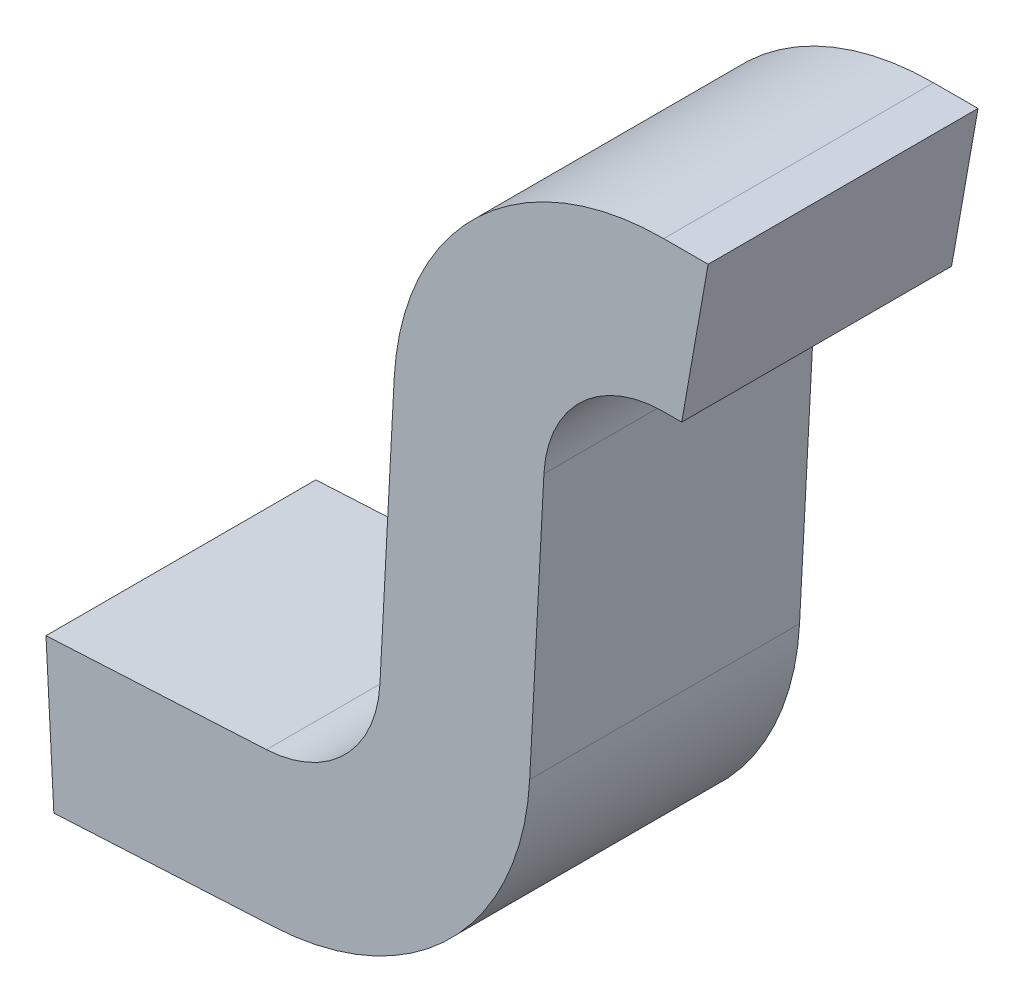
ISO-10303-21;
HEADER;
FILE_DESCRIPTION(('STEP AP214'),'2;1');
FILE_NAME('part.step','',(''),(''),'','','');
FILE_SCHEMA(('AUTOMOTIVE_DESIGN { 1 0 10303 214 1 1 1 1 }'));
ENDSEC;
DATA;
#1=APPLICATION_CONTEXT('core data for automotive mechanical design processes');
#2=APPLICATION_PROTOCOL_DEFINITION('international standard','automotive_design',2000,#1);
#3=PRODUCT_CONTEXT('',#1,'mechanical');
#4=PRODUCT('Part','Part','',(#3));
#5=PRODUCT_RELATED_PRODUCT_CATEGORY('part','',(#4));
#6=PRODUCT_DEFINITION_FORMATION('','',#4);
#7=PRODUCT_DEFINITION_CONTEXT('part definition',#1,'design');
#8=PRODUCT_DEFINITION('design','',#6,#7);
#9=PRODUCT_DEFINITION_SHAPE('','',#8);
#10=(LENGTH_UNIT() NAMED_UNIT(*) SI_UNIT(.MILLI.,.METRE.));
#11=(NAMED_UNIT(*) PLANE_ANGLE_UNIT() SI_UNIT($,.RADIAN.));
#12=(NAMED_UNIT(*) SI_UNIT($,.STERADIAN.) SOLID_ANGLE_UNIT());
#13=UNCERTAINTY_MEASURE_WITH_UNIT(LENGTH_MEASURE(1.E-05),#10,'distance_accuracy_value','');
#14=(GEOMETRIC_REPRESENTATION_CONTEXT(3) GLOBAL_UNCERTAINTY_ASSIGNED_CONTEXT((#13)) GLOBAL_UNIT_ASSIGNED_CONTEXT((#10,
#11,#12)) REPRESENTATION_CONTEXT('',''));
#15=CARTESIAN_POINT('',(0.,0.,0.));
#16=DIRECTION('',(0.,0.,1.));
#17=DIRECTION('',(1.,0.,0.));
#18=AXIS2_PLACEMENT_3D('',#15,#16,#17);
#19=CARTESIAN_POINT('',(0.,0.,-0.5375));
#20=DIRECTION('',(0.,0.,-1.));
#21=DIRECTION('',(-1.,0.,0.));
#22=AXIS2_PLACEMENT_3D('',#19,#20,#21);
#23=PLANE('',#22);
#24=DIRECTION('',(0.0523359562429177,0.998629534754575,0.));
#25=VECTOR('',#24,1.);
#26=CARTESIAN_POINT('',(-0.861573213012,-0.31493822705,-0.5375));
#27=LINE('',#26,#25);
#28=CARTESIAN_POINT('',(-0.849691645319655,-0.0882244098453541,-0.5375));
#29=VERTEX_POINT('',#28);
#30=CARTESIAN_POINT('',(-0.861573213012008,-0.31493822705016,-0.5375));
#31=VERTEX_POINT('',#30);
#32=EDGE_CURVE('E145',#29,#31,#27,.F.);
#33=ORIENTED_EDGE('',*,*,#32,.T.);
#34=CARTESIAN_POINT('',(-0.961436166488,-0.309704631426,-0.5375));
#35=DIRECTION('',(0.,0.,-1.));
#36=DIRECTION('',(-1.,0.,0.));
#37=AXIS2_PLACEMENT_3D('',#34,#35,#36);
#38=CIRCLE('',#37,0.1);
#39=CARTESIAN_POINT('',(-0.956202570863354,-0.40956758490123,-0.5375));
#40=VERTEX_POINT('',#39);
#41=EDGE_CURVE('E181',#31,#40,#38,.T.);
#42=ORIENTED_EDGE('',*,*,#41,.T.);
#43=DIRECTION('',(0.998629534754575,0.0523359562429177,0.));
#44=VECTOR('',#43,1.);
#45=CARTESIAN_POINT('',(-1.14,-0.4192,-0.5375));
#46=LINE('',#45,#44);
#47=CARTESIAN_POINT('',(-1.14000000000012,-0.419200000000006,-0.5375));
#48=VERTEX_POINT('',#47);
#49=EDGE_CURVE('E149',#40,#48,#46,.F.);
#50=ORIENTED_EDGE('',*,*,#49,.T.);
#51=DIRECTION('',(-0.0523359562429177,0.998629534754575,0.));
#52=VECTOR('',#51,1.);
#53=CARTESIAN_POINT('',(-1.13345800547,-0.544028691844,-0.5375));
#54=LINE('',#53,#52);
#55=CARTESIAN_POINT('',(-1.13345800547,-0.544028691843999,-0.5375));
#56=VERTEX_POINT('',#55);
#57=EDGE_CURVE('E155',#48,#56,#54,.F.);
#58=ORIENTED_EDGE('',*,*,#57,.T.);
#59=DIRECTION('',(-0.998629534754575,-0.0523359562429177,0.));
#60=VECTOR('',#59,1.);
#61=CARTESIAN_POINT('',(-0.949660576333,-0.534396276745,-0.5375));
#62=LINE('',#61,#60);
#63=CARTESIAN_POINT('',(-0.949660576333192,-0.53439627674501,-0.5375));
#64=VERTEX_POINT('',#63);
#65=EDGE_CURVE('E160',#56,#64,#62,.F.);
#66=ORIENTED_EDGE('',*,*,#65,.T.);
#67=CARTESIAN_POINT('',(-0.961436166488,-0.309704631426,-0.5375));
#68=DIRECTION('',(0.,0.,-1.));
#69=DIRECTION('',(-1.,0.,0.));
#70=AXIS2_PLACEMENT_3D('',#67,#68,#69);
#71=CIRCLE('',#70,0.225);
#72=CARTESIAN_POINT('',(-0.736744521168336,-0.321480221580316,-0.5375));
#73=VERTEX_POINT('',#72);
#74=EDGE_CURVE('E108',#73,#64,#71,.T.);
#75=ORIENTED_EDGE('',*,*,#74,.F.);
#76=DIRECTION('',(-0.0523359562429177,-0.998629534754575,0.));
#77=VECTOR('',#76,1.);
#78=CARTESIAN_POINT('',(-0.724862953476,-0.09476640437571,-0.5375));
#79=LINE('',#78,#77);
#80=CARTESIAN_POINT('',(-0.724862953475999,-0.0947664043756949,-0.5375));
#81=VERTEX_POINT('',#80);
#82=EDGE_CURVE('E103',#73,#81,#79,.F.);
#83=ORIENTED_EDGE('',*,*,#82,.T.);
#84=CARTESIAN_POINT('',(-0.625,-0.1,-0.5375));
#85=DIRECTION('',(0.,0.,-1.));
#86=DIRECTION('',(-1.,0.,0.));
#87=AXIS2_PLACEMENT_3D('',#84,#85,#86);
#88=CIRCLE('',#87,0.1);
#89=CARTESIAN_POINT('',(-0.625,0.,-0.5375));
#90=VERTEX_POINT('',#89);
#91=EDGE_CURVE('E20',#81,#90,#88,.T.);
#92=ORIENTED_EDGE('',*,*,#91,.T.);
#93=DIRECTION('',(1.,0.,0.));
#94=VECTOR('',#93,1.);
#95=CARTESIAN_POINT('',(-0.61,0.,-0.5375));
#96=LINE('',#95,#94);
#97=CARTESIAN_POINT('',(-0.609999999999862,0.,-0.5375));
#98=VERTEX_POINT('',#97);
#99=EDGE_CURVE('E129',#90,#98,#96,.T.);
#100=ORIENTED_EDGE('',*,*,#99,.T.);
#101=DIRECTION('',(-0.173648177667033,-0.98480775301219,0.));
#102=VECTOR('',#101,1.);
#103=CARTESIAN_POINT('',(-0.587959127411,0.125,-0.5375));
#104=LINE('',#103,#102);
#105=CARTESIAN_POINT('',(-0.587959127411,0.125,-0.5375));
#106=VERTEX_POINT('',#105);
#107=EDGE_CURVE('E134',#98,#106,#104,.F.);
#108=ORIENTED_EDGE('',*,*,#107,.T.);
#109=DIRECTION('',(1.,0.,0.));
#110=VECTOR('',#109,1.);
#111=CARTESIAN_POINT('',(-0.625,0.125,-0.5375));
#112=LINE('',#111,#110);
#113=CARTESIAN_POINT('',(-0.625,0.125,-0.5375));
#114=VERTEX_POINT('',#113);
#115=EDGE_CURVE('E140',#106,#114,#112,.F.);
#116=ORIENTED_EDGE('',*,*,#115,.T.);
#117=CARTESIAN_POINT('',(-0.625,-0.1,-0.5375));
#118=DIRECTION('',(0.,0.,-1.));
#119=DIRECTION('',(-1.,0.,0.));
#120=AXIS2_PLACEMENT_3D('',#117,#118,#119);
#121=CIRCLE('',#120,0.225);
#122=EDGE_CURVE('E142',#29,#114,#121,.T.);
#123=ORIENTED_EDGE('',*,*,#122,.F.);
#124=EDGE_LOOP('',(#33,#42,#50,#58,#66,#75,#83,#92,#100,#108,#116,#123));
#125=FACE_BOUND('',#124,.T.);
#126=ADVANCED_FACE('F17',(#125),#23,.F.);
#127=CARTESIAN_POINT('',(-0.625,-0.1,-0.7625));
#128=DIRECTION('',(0.,0.,-1.));
#129=DIRECTION('',(-1.,0.,0.));
#130=AXIS2_PLACEMENT_3D('',#127,#128,#129);
#131=CYLINDRICAL_SURFACE('',#130,0.1);
#132=ORIENTED_EDGE('',*,*,#91,.F.);
#133=DIRECTION('',(0.,0.,1.));
#134=VECTOR('',#133,1.);
#135=CARTESIAN_POINT('',(-0.724862953476,-0.09476640437571,-0.7625));
#136=LINE('',#135,#134);
#137=CARTESIAN_POINT('',(-0.724862953476004,-0.0947664043757943,-0.7625));
#138=VERTEX_POINT('',#137);
#139=EDGE_CURVE('E112',#81,#138,#136,.F.);
#140=ORIENTED_EDGE('',*,*,#139,.T.);
#141=CARTESIAN_POINT('',(-0.625,-0.1,-0.7625));
#142=DIRECTION('',(0.,0.,-1.));
#143=DIRECTION('',(-1.,0.,0.));
#144=AXIS2_PLACEMENT_3D('',#141,#142,#143);
#145=CIRCLE('',#144,0.1);
#146=CARTESIAN_POINT('',(-0.625,0.,-0.7625));
#147=VERTEX_POINT('',#146);
#148=EDGE_CURVE('E131',#147,#138,#145,.F.);
#149=ORIENTED_EDGE('',*,*,#148,.F.);
#150=DIRECTION('',(0.,0.,1.));
#151=VECTOR('',#150,1.);
#152=CARTESIAN_POINT('',(-0.625,0.,-0.7625));
#153=LINE('',#152,#151);
#154=EDGE_CURVE('E118',#147,#90,#153,.T.);
#155=ORIENTED_EDGE('',*,*,#154,.T.);
#156=EDGE_LOOP('',(#132,#140,#149,#155));
#157=FACE_BOUND('',#156,.T.);
#158=ADVANCED_FACE('F115',(#157),#131,.F.);
#159=CARTESIAN_POINT('',(-0.724862953476,-0.09476640437571,-0.7625));
#160=DIRECTION('',(-0.998629534754575,0.0523359562429177,0.));
#161=DIRECTION('',(-0.0523359562429177,-0.998629534754575,0.));
#162=AXIS2_PLACEMENT_3D('',#159,#160,#161);
#163=PLANE('',#162);
#164=ORIENTED_EDGE('',*,*,#82,.F.);
#165=DIRECTION('',(0.,0.,-1.));
#166=VECTOR('',#165,1.);
#167=CARTESIAN_POINT('',(-0.736744521168186,-0.32148022157999,-0.7625));
#168=LINE('',#167,#166);
#169=CARTESIAN_POINT('',(-0.736744521168099,-0.321480221580105,-0.7625));
#170=VERTEX_POINT('',#169);
#171=EDGE_CURVE('E124',#170,#73,#168,.F.);
#172=ORIENTED_EDGE('',*,*,#171,.F.);
#173=DIRECTION('',(-0.0523359562409312,-0.998629534754679,0.));
#174=VECTOR('',#173,1.);
#175=CARTESIAN_POINT('',(-0.724862953476,-0.09476640437571,-0.7625));
#176=LINE('',#175,#174);
#177=EDGE_CURVE('E122',#138,#170,#176,.T.);
#178=ORIENTED_EDGE('',*,*,#177,.F.);
#179=ORIENTED_EDGE('',*,*,#139,.F.);
#180=EDGE_LOOP('',(#164,#172,#178,#179));
#181=FACE_BOUND('',#180,.T.);
#182=ADVANCED_FACE('F120',(#181),#163,.F.);
#183=CARTESIAN_POINT('',(-0.961436166488,-0.309704631426,-0.7625));
#184=DIRECTION('',(0.,0.,-1.));
#185=DIRECTION('',(-1.,0.,0.));
#186=AXIS2_PLACEMENT_3D('',#183,#184,#185);
#187=CYLINDRICAL_SURFACE('',#186,0.225);
#188=DIRECTION('',(0.,0.,1.));
#189=VECTOR('',#188,1.);
#190=CARTESIAN_POINT('',(-0.949660576333,-0.534396276745,-0.7625));
#191=LINE('',#190,#189);
#192=CARTESIAN_POINT('',(-0.94966057633319,-0.53439627674501,-0.7625));
#193=VERTEX_POINT('',#192);
#194=EDGE_CURVE('E157',#64,#193,#191,.F.);
#195=ORIENTED_EDGE('',*,*,#194,.T.);
#196=CARTESIAN_POINT('',(-0.961436166488,-0.309704631426,-0.7625));
#197=DIRECTION('',(0.,0.,-1.));
#198=DIRECTION('',(-1.,0.,0.));
#199=AXIS2_PLACEMENT_3D('',#196,#197,#198);
#200=CIRCLE('',#199,0.225);
#201=EDGE_CURVE('E173',#170,#193,#200,.T.);
#202=ORIENTED_EDGE('',*,*,#201,.F.);
#203=ORIENTED_EDGE('',*,*,#171,.T.);
#204=ORIENTED_EDGE('',*,*,#74,.T.);
#205=EDGE_LOOP('',(#195,#202,#203,#204));
#206=FACE_BOUND('',#205,.T.);
#207=ADVANCED_FACE('F184',(#206),#187,.T.);
#208=CARTESIAN_POINT('',(-0.949660576333,-0.534396276745,-0.7625));
#209=DIRECTION('',(-0.0523359562429177,0.998629534754575,0.));
#210=DIRECTION('',(-0.998629534754575,-0.0523359562429177,0.));
#211=AXIS2_PLACEMENT_3D('',#208,#209,#210);
#212=PLANE('',#211);
#213=ORIENTED_EDGE('',*,*,#65,.F.);
#214=DIRECTION('',(0.,0.,1.));
#215=VECTOR('',#214,1.);
#216=CARTESIAN_POINT('',(-1.13345800547,-0.544028691844,-0.7625));
#217=LINE('',#216,#215);
#218=CARTESIAN_POINT('',(-1.13345800547,-0.544028691844,-0.7625));
#219=VERTEX_POINT('',#218);
#220=EDGE_CURVE('E152',#56,#219,#217,.F.);
#221=ORIENTED_EDGE('',*,*,#220,.T.);
#222=DIRECTION('',(-0.998629534754574,-0.0523359562429318,0.));
#223=VECTOR('',#222,1.);
#224=CARTESIAN_POINT('',(-0.949660576333,-0.534396276745,-0.7625));
#225=LINE('',#224,#223);
#226=EDGE_CURVE('E176',#193,#219,#225,.T.);
#227=ORIENTED_EDGE('',*,*,#226,.F.);
#228=ORIENTED_EDGE('',*,*,#194,.F.);
#229=EDGE_LOOP('',(#213,#221,#227,#228));
#230=FACE_BOUND('',#229,.T.);
#231=ADVANCED_FACE('F189',(#230),#212,.F.);
#232=CARTESIAN_POINT('',(-1.13345800547,-0.544028691844,-0.7625));
#233=DIRECTION('',(0.998629534754575,0.0523359562429177,0.));
#234=DIRECTION('',(-0.0523359562429177,0.998629534754575,0.));
#235=AXIS2_PLACEMENT_3D('',#232,#233,#234);
#236=PLANE('',#235);
#237=ORIENTED_EDGE('',*,*,#57,.F.);
#238=DIRECTION('',(0.,0.,1.));
#239=VECTOR('',#238,1.);
#240=CARTESIAN_POINT('',(-1.14,-0.4192,-0.7625));
#241=LINE('',#240,#239);
#242=CARTESIAN_POINT('',(-1.14,-0.4192,-0.7625));
#243=VERTEX_POINT('',#242);
#244=EDGE_CURVE('E151',#48,#243,#241,.F.);
#245=ORIENTED_EDGE('',*,*,#244,.T.);
#246=DIRECTION('',(-0.0523359562401418,0.998629534754721,0.));
#247=VECTOR('',#246,1.);
#248=CARTESIAN_POINT('',(-1.13345800547,-0.544028691844,-0.7625));
#249=LINE('',#248,#247);
#250=EDGE_CURVE('E198',#219,#243,#249,.T.);
#251=ORIENTED_EDGE('',*,*,#250,.F.);
#252=ORIENTED_EDGE('',*,*,#220,.F.);
#253=EDGE_LOOP('',(#237,#245,#251,#252));
#254=FACE_BOUND('',#253,.T.);
#255=ADVANCED_FACE('F319',(#254),#236,.F.);
#256=CARTESIAN_POINT('',(-1.14,-0.4192,-0.7625));
#257=DIRECTION('',(0.0523359562429177,-0.998629534754575,0.));
#258=DIRECTION('',(0.998629534754575,0.0523359562429177,0.));
#259=AXIS2_PLACEMENT_3D('',#256,#257,#258);
#260=PLANE('',#259);
#261=ORIENTED_EDGE('',*,*,#49,.F.);
#262=DIRECTION('',(0.,0.,-1.));
#263=VECTOR('',#262,1.);
#264=CARTESIAN_POINT('',(-0.956202570862978,-0.409567584901419,-0.7625));
#265=LINE('',#264,#263);
#266=CARTESIAN_POINT('',(-0.956202570863353,-0.409567584901229,-0.7625));
#267=VERTEX_POINT('',#266);
#268=EDGE_CURVE('E148',#40,#267,#265,.T.);
#269=ORIENTED_EDGE('',*,*,#268,.T.);
#270=DIRECTION('',(0.998629534754574,0.0523359562429318,0.));
#271=VECTOR('',#270,1.);
#272=CARTESIAN_POINT('',(-1.14,-0.4192,-0.7625));
#273=LINE('',#272,#271);
#274=EDGE_CURVE('E172',#243,#267,#273,.T.);
#275=ORIENTED_EDGE('',*,*,#274,.F.);
#276=ORIENTED_EDGE('',*,*,#244,.F.);
#277=EDGE_LOOP('',(#261,#269,#275,#276));
#278=FACE_BOUND('',#277,.T.);
#279=ADVANCED_FACE('F309',(#278),#260,.F.);
#280=CARTESIAN_POINT('',(-0.961436166488,-0.309704631426,-0.7625));
#281=DIRECTION('',(0.,0.,-1.));
#282=DIRECTION('',(-1.,0.,0.));
#283=AXIS2_PLACEMENT_3D('',#280,#281,#282);
#284=CYLINDRICAL_SURFACE('',#283,0.1);
#285=ORIENTED_EDGE('',*,*,#41,.F.);
#286=DIRECTION('',(0.,0.,1.));
#287=VECTOR('',#286,1.);
#288=CARTESIAN_POINT('',(-0.861573213012,-0.31493822705,-0.7625));
#289=LINE('',#288,#287);
#290=CARTESIAN_POINT('',(-0.861573213012003,-0.314938227050056,-0.7625));
#291=VERTEX_POINT('',#290);
#292=EDGE_CURVE('E147',#31,#291,#289,.F.);
#293=ORIENTED_EDGE('',*,*,#292,.T.);
#294=CARTESIAN_POINT('',(-0.961436166488,-0.309704631426,-0.7625));
#295=DIRECTION('',(0.,0.,-1.));
#296=DIRECTION('',(-1.,0.,0.));
#297=AXIS2_PLACEMENT_3D('',#294,#295,#296);
#298=CIRCLE('',#297,0.1);
#299=EDGE_CURVE('E169',#267,#291,#298,.F.);
#300=ORIENTED_EDGE('',*,*,#299,.F.);
#301=ORIENTED_EDGE('',*,*,#268,.F.);
#302=EDGE_LOOP('',(#285,#293,#300,#301));
#303=FACE_BOUND('',#302,.T.);
#304=ADVANCED_FACE('F299',(#303),#284,.F.);
#305=CARTESIAN_POINT('',(-0.861573213012,-0.31493822705,-0.7625));
#306=DIRECTION('',(0.998629534754575,-0.0523359562429177,0.));
#307=DIRECTION('',(0.0523359562429177,0.998629534754575,0.));
#308=AXIS2_PLACEMENT_3D('',#305,#306,#307);
#309=PLANE('',#308);
#310=ORIENTED_EDGE('',*,*,#32,.F.);
#311=DIRECTION('',(0.,0.,-1.));
#312=VECTOR('',#311,1.);
#313=CARTESIAN_POINT('',(-0.84969164531978,-0.0882244098453515,-0.7625));
#314=LINE('',#313,#312);
#315=CARTESIAN_POINT('',(-0.849691645319902,-0.0882244098455748,-0.7625));
#316=VERTEX_POINT('',#315);
#317=EDGE_CURVE('E180',#316,#29,#314,.F.);
#318=ORIENTED_EDGE('',*,*,#317,.F.);
#319=DIRECTION('',(0.052335956240846,0.998629534754684,0.));
#320=VECTOR('',#319,1.);
#321=CARTESIAN_POINT('',(-0.861573213012,-0.31493822705,-0.7625));
#322=LINE('',#321,#320);
#323=EDGE_CURVE('E168',#291,#316,#322,.T.);
#324=ORIENTED_EDGE('',*,*,#323,.F.);
#325=ORIENTED_EDGE('',*,*,#292,.F.);
#326=EDGE_LOOP('',(#310,#318,#324,#325));
#327=FACE_BOUND('',#326,.T.);
#328=ADVANCED_FACE('F289',(#327),#309,.F.);
#329=CARTESIAN_POINT('',(-0.625,-0.1,-0.7625));
#330=DIRECTION('',(0.,0.,-1.));
#331=DIRECTION('',(-1.,0.,0.));
#332=AXIS2_PLACEMENT_3D('',#329,#330,#331);
#333=CYLINDRICAL_SURFACE('',#332,0.225);
#334=DIRECTION('',(0.,0.,-1.));
#335=VECTOR('',#334,1.);
#336=CARTESIAN_POINT('',(-0.625,0.125,-0.7625));
#337=LINE('',#336,#335);
#338=CARTESIAN_POINT('',(-0.625,0.125,-0.7625));
#339=VERTEX_POINT('',#338);
#340=EDGE_CURVE('E137',#114,#339,#337,.T.);
#341=ORIENTED_EDGE('',*,*,#340,.T.);
#342=CARTESIAN_POINT('',(-0.625,-0.1,-0.7625));
#343=DIRECTION('',(0.,0.,-1.));
#344=DIRECTION('',(-1.,0.,0.));
#345=AXIS2_PLACEMENT_3D('',#342,#343,#344);
#346=CIRCLE('',#345,0.225);
#347=EDGE_CURVE('E164',#316,#339,#346,.T.);
#348=ORIENTED_EDGE('',*,*,#347,.F.);
#349=ORIENTED_EDGE('',*,*,#317,.T.);
#350=ORIENTED_EDGE('',*,*,#122,.T.);
#351=EDGE_LOOP('',(#341,#348,#349,#350));
#352=FACE_BOUND('',#351,.T.);
#353=ADVANCED_FACE('F255',(#352),#333,.T.);
#354=CARTESIAN_POINT('',(-0.625,0.125,-0.7625));
#355=DIRECTION('',(0.,-1.,0.));
#356=DIRECTION('',(0.,0.,-1.));
#357=AXIS2_PLACEMENT_3D('',#354,#355,#356);
#358=PLANE('',#357);
#359=ORIENTED_EDGE('',*,*,#115,.F.);
#360=DIRECTION('',(0.,0.,1.));
#361=VECTOR('',#360,1.);
#362=CARTESIAN_POINT('',(-0.587959127411,0.125,-0.7625));
#363=LINE('',#362,#361);
#364=CARTESIAN_POINT('',(-0.587959127411,0.125,-0.7625));
#365=VERTEX_POINT('',#364);
#366=EDGE_CURVE('E136',#106,#365,#363,.F.);
#367=ORIENTED_EDGE('',*,*,#366,.T.);
#368=DIRECTION('',(-1.,0.,0.));
#369=VECTOR('',#368,1.);
#370=CARTESIAN_POINT('',(0.,0.125,-0.7625));
#371=LINE('',#370,#369);
#372=EDGE_CURVE('E167',#339,#365,#371,.F.);
#373=ORIENTED_EDGE('',*,*,#372,.F.);
#374=ORIENTED_EDGE('',*,*,#340,.F.);
#375=EDGE_LOOP('',(#359,#367,#373,#374));
#376=FACE_BOUND('',#375,.T.);
#377=ADVANCED_FACE('F242',(#376),#358,.F.);
#378=CARTESIAN_POINT('',(-0.587959127411,0.125,-0.7625));
#379=DIRECTION('',(-0.98480775301219,0.173648177667033,0.));
#380=DIRECTION('',(-0.173648177667033,-0.98480775301219,0.));
#381=AXIS2_PLACEMENT_3D('',#378,#379,#380);
#382=PLANE('',#381);
#383=ORIENTED_EDGE('',*,*,#366,.F.);
#384=ORIENTED_EDGE('',*,*,#107,.F.);
#385=DIRECTION('',(0.,0.,1.));
#386=VECTOR('',#385,1.);
#387=CARTESIAN_POINT('',(-0.61,0.,-0.7625));
#388=LINE('',#387,#386);
#389=CARTESIAN_POINT('',(-0.61,0.,-0.7625));
#390=VERTEX_POINT('',#389);
#391=EDGE_CURVE('E35',#98,#390,#388,.F.);
#392=ORIENTED_EDGE('',*,*,#391,.T.);
#393=DIRECTION('',(-0.173648177670306,-0.984807753011613,0.));
#394=VECTOR('',#393,1.);
#395=CARTESIAN_POINT('',(-0.587959127411,0.125,-0.7625));
#396=LINE('',#395,#394);
#397=EDGE_CURVE('E26',#365,#390,#396,.T.);
#398=ORIENTED_EDGE('',*,*,#397,.F.);
#399=EDGE_LOOP('',(#383,#384,#392,#398));
#400=FACE_BOUND('',#399,.T.);
#401=ADVANCED_FACE('F244',(#400),#382,.F.);
#402=CARTESIAN_POINT('',(-0.61,0.,-0.7625));
#403=DIRECTION('',(0.,1.,0.));
#404=DIRECTION('',(0.,0.,1.));
#405=AXIS2_PLACEMENT_3D('',#402,#403,#404);
#406=PLANE('',#405);
#407=ORIENTED_EDGE('',*,*,#154,.F.);
#408=DIRECTION('',(-1.,0.,0.));
#409=VECTOR('',#408,1.);
#410=CARTESIAN_POINT('',(0.,0.,-0.7625));
#411=LINE('',#410,#409);
#412=EDGE_CURVE('E11',#390,#147,#411,.T.);
#413=ORIENTED_EDGE('',*,*,#412,.F.);
#414=ORIENTED_EDGE('',*,*,#391,.F.);
#415=ORIENTED_EDGE('',*,*,#99,.F.);
#416=EDGE_LOOP('',(#407,#413,#414,#415));
#417=FACE_BOUND('',#416,.T.);
#418=ADVANCED_FACE('F246',(#417),#406,.F.);
#419=CARTESIAN_POINT('',(0.,0.,-0.7625));
#420=DIRECTION('',(0.,0.,-1.));
#421=DIRECTION('',(-1.,0.,0.));
#422=AXIS2_PLACEMENT_3D('',#419,#420,#421);
#423=PLANE('',#422);
#424=ORIENTED_EDGE('',*,*,#397,.T.);
#425=ORIENTED_EDGE('',*,*,#412,.T.);
#426=ORIENTED_EDGE('',*,*,#148,.T.);
#427=ORIENTED_EDGE('',*,*,#177,.T.);
#428=ORIENTED_EDGE('',*,*,#201,.T.);
#429=ORIENTED_EDGE('',*,*,#226,.T.);
#430=ORIENTED_EDGE('',*,*,#250,.T.);
#431=ORIENTED_EDGE('',*,*,#274,.T.);
#432=ORIENTED_EDGE('',*,*,#299,.T.);
#433=ORIENTED_EDGE('',*,*,#323,.T.);
#434=ORIENTED_EDGE('',*,*,#347,.T.);
#435=ORIENTED_EDGE('',*,*,#372,.T.);
#436=EDGE_LOOP('',(#424,#425,#426,#427,#428,#429,#430,#431,#432,#433,#434,#435));
#437=FACE_BOUND('',#436,.T.);
#438=ADVANCED_FACE('F237',(#437),#423,.T.);
#439=CLOSED_SHELL('',(#126,#158,#182,#207,#231,#255,#279,#304,#328,#353,#377,#401,#418,#438));
#440=MANIFOLD_SOLID_BREP('B1',#439);
#441=ADVANCED_BREP_SHAPE_REPRESENTATION('',(#18,#440),#14);
#442=SHAPE_DEFINITION_REPRESENTATION(#9,#441);
ENDSEC;
END-ISO-10303-21;
